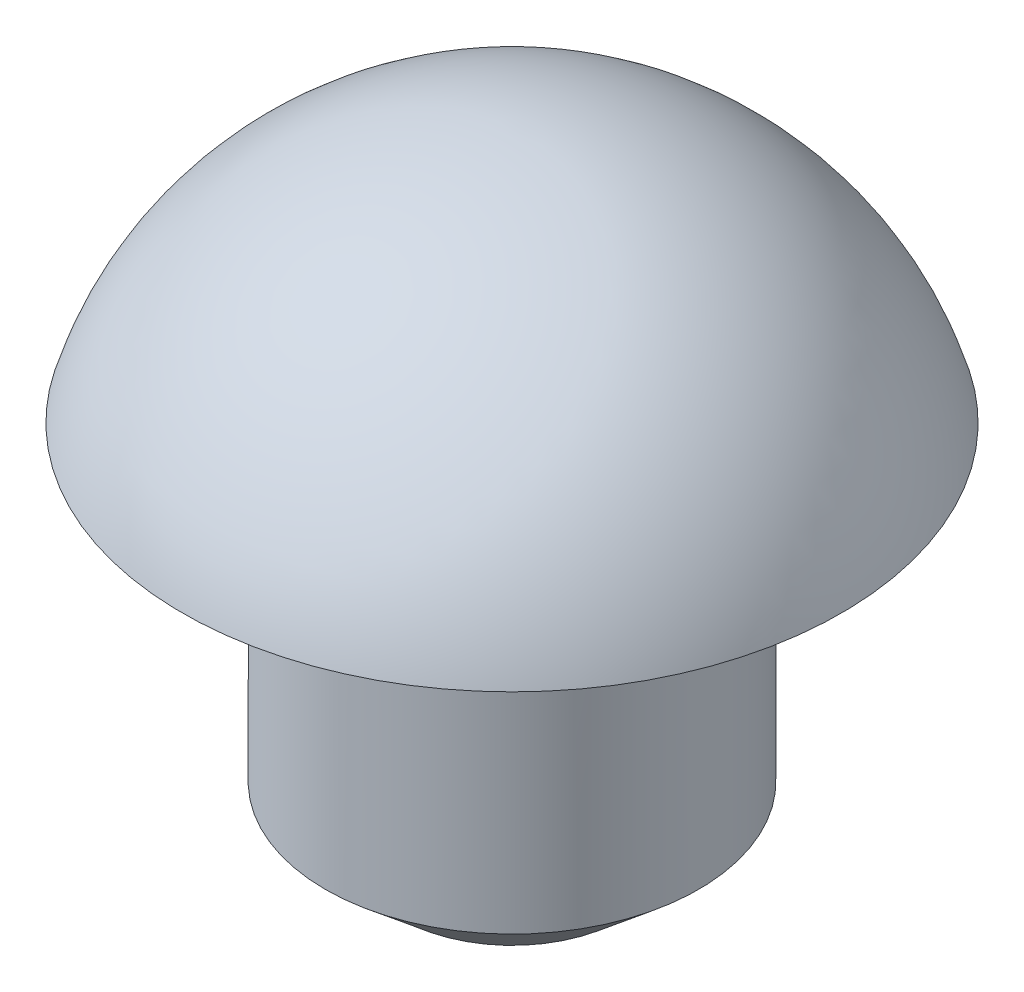
ISO-10303-21;
HEADER;
FILE_DESCRIPTION(('STEP AP214'),'2;1');
FILE_NAME('part.step','',(''),(''),'','','');
FILE_SCHEMA(('AUTOMOTIVE_DESIGN { 1 0 10303 214 1 1 1 1 }'));
ENDSEC;
DATA;
#1=APPLICATION_CONTEXT('core data for automotive mechanical design processes');
#2=APPLICATION_PROTOCOL_DEFINITION('international standard','automotive_design',2000,#1);
#3=PRODUCT_CONTEXT('',#1,'mechanical');
#4=PRODUCT('Part','Part','',(#3));
#5=PRODUCT_RELATED_PRODUCT_CATEGORY('part','',(#4));
#6=PRODUCT_DEFINITION_FORMATION('','',#4);
#7=PRODUCT_DEFINITION_CONTEXT('part definition',#1,'design');
#8=PRODUCT_DEFINITION('design','',#6,#7);
#9=PRODUCT_DEFINITION_SHAPE('','',#8);
#10=(LENGTH_UNIT() NAMED_UNIT(*) SI_UNIT(.MILLI.,.METRE.));
#11=(NAMED_UNIT(*) PLANE_ANGLE_UNIT() SI_UNIT($,.RADIAN.));
#12=(NAMED_UNIT(*) SI_UNIT($,.STERADIAN.) SOLID_ANGLE_UNIT());
#13=UNCERTAINTY_MEASURE_WITH_UNIT(LENGTH_MEASURE(1.E-05),#10,'distance_accuracy_value','');
#14=(GEOMETRIC_REPRESENTATION_CONTEXT(3) GLOBAL_UNCERTAINTY_ASSIGNED_CONTEXT((#13)) GLOBAL_UNIT_ASSIGNED_CONTEXT((#10,
#11,#12)) REPRESENTATION_CONTEXT('',''));
#15=CARTESIAN_POINT('',(0.,0.,0.));
#16=DIRECTION('',(0.,0.,1.));
#17=DIRECTION('',(1.,0.,0.));
#18=AXIS2_PLACEMENT_3D('',#15,#16,#17);
#19=CARTESIAN_POINT('',(-2.65,0.500000000000002,0.));
#20=DIRECTION('',(0.,-1.,0.));
#21=DIRECTION('',(0.,0.,-1.));
#22=AXIS2_PLACEMENT_3D('',#19,#20,#21);
#23=PLANE('',#22);
#24=CARTESIAN_POINT('',(0.,0.5,0.));
#25=DIRECTION('',(0.,-1.,0.));
#26=DIRECTION('',(0.,0.,-1.));
#27=AXIS2_PLACEMENT_3D('',#24,#25,#26);
#28=CIRCLE('',#27,2.65);
#29=CARTESIAN_POINT('',(0.,0.5,-2.65));
#30=VERTEX_POINT('',#29);
#31=EDGE_CURVE('E47',#30,#30,#28,.T.);
#32=ORIENTED_EDGE('',*,*,#31,.T.);
#33=EDGE_LOOP('',(#32));
#34=FACE_BOUND('',#33,.T.);
#35=CARTESIAN_POINT('',(0.,0.500000000000002,0.));
#36=DIRECTION('',(0.,-1.,0.));
#37=DIRECTION('',(0.,0.,-1.));
#38=AXIS2_PLACEMENT_3D('',#35,#36,#37);
#39=CIRCLE('',#38,1.5);
#40=CARTESIAN_POINT('',(0.,0.500000000000002,-1.5));
#41=VERTEX_POINT('',#40);
#42=EDGE_CURVE('E49',#41,#41,#39,.T.);
#43=ORIENTED_EDGE('',*,*,#42,.F.);
#44=EDGE_LOOP('',(#43));
#45=FACE_BOUND('',#44,.T.);
#46=ADVANCED_FACE('F30',(#34,#45),#23,.T.);
#47=CARTESIAN_POINT('',(0.,-7.45771041021499,0.));
#48=DIRECTION('',(0.,-1.,0.));
#49=DIRECTION('',(0.,0.,-1.));
#50=AXIS2_PLACEMENT_3D('',#47,#48,#49);
#51=CYLINDRICAL_SURFACE('',#50,1.5);
#52=CARTESIAN_POINT('',(0.,-1.99999999999999,0.));
#53=DIRECTION('',(0.,1.,0.));
#54=DIRECTION('',(0.,0.,1.));
#55=AXIS2_PLACEMENT_3D('',#52,#53,#54);
#56=CIRCLE('',#55,1.5);
#57=CARTESIAN_POINT('',(0.,-1.99999999999999,1.5));
#58=VERTEX_POINT('',#57);
#59=EDGE_CURVE('E11',#58,#58,#56,.T.);
#60=ORIENTED_EDGE('',*,*,#59,.T.);
#61=EDGE_LOOP('',(#60));
#62=FACE_BOUND('',#61,.T.);
#63=ORIENTED_EDGE('',*,*,#42,.T.);
#64=EDGE_LOOP('',(#63));
#65=FACE_BOUND('',#64,.T.);
#66=ADVANCED_FACE('F63',(#62,#65),#51,.T.);
#67=CARTESIAN_POINT('',(-2.65,-2.5,0.));
#68=DIRECTION('',(0.,1.,0.));
#69=DIRECTION('',(0.,0.,1.));
#70=AXIS2_PLACEMENT_3D('',#67,#68,#69);
#71=PLANE('',#70);
#72=CARTESIAN_POINT('',(0.,-2.5,0.));
#73=DIRECTION('',(0.,1.,0.));
#74=DIRECTION('',(0.,0.,1.));
#75=AXIS2_PLACEMENT_3D('',#72,#73,#74);
#76=CIRCLE('',#75,0.904123203702891);
#77=CARTESIAN_POINT('',(0.,-2.5,0.904123203702891));
#78=VERTEX_POINT('',#77);
#79=EDGE_CURVE('E37',#78,#78,#76,.F.);
#80=ORIENTED_EDGE('',*,*,#79,.T.);
#81=EDGE_LOOP('',(#80));
#82=FACE_BOUND('',#81,.T.);
#83=ADVANCED_FACE('F43',(#82),#71,.F.);
#84=CARTESIAN_POINT('',(0.,-0.255624999999997,0.));
#85=DIRECTION('',(0.,-1.,0.));
#86=DIRECTION('',(-1.,0.,0.));
#87=AXIS2_PLACEMENT_3D('',#84,#85,#86);
#88=SPHERICAL_SURFACE('',#87,2.755625);
#89=CARTESIAN_POINT('',(0.,2.5,0.));
#90=VERTEX_POINT('',#89);
#91=VERTEX_LOOP('',#90);
#92=FACE_BOUND('',#91,.T.);
#93=ORIENTED_EDGE('',*,*,#31,.F.);
#94=EDGE_LOOP('',(#93));
#95=FACE_BOUND('',#94,.T.);
#96=ADVANCED_FACE('F40',(#92,#95),#88,.T.);
#97=CARTESIAN_POINT('',(0.,-2.5,0.));
#98=DIRECTION('',(0.,1.,0.));
#99=DIRECTION('',(0.,0.,1.));
#100=AXIS2_PLACEMENT_3D('',#97,#98,#99);
#101=CONICAL_SURFACE('',#100,0.904123203702892,0.872664625997163);
#102=ORIENTED_EDGE('',*,*,#59,.F.);
#103=EDGE_LOOP('',(#102));
#104=FACE_BOUND('',#103,.T.);
#105=ORIENTED_EDGE('',*,*,#79,.F.);
#106=EDGE_LOOP('',(#105));
#107=FACE_BOUND('',#106,.T.);
#108=ADVANCED_FACE('F32',(#104,#107),#101,.T.);
#109=CLOSED_SHELL('',(#46,#66,#83,#96,#108));
#110=MANIFOLD_SOLID_BREP('B2',#109);
#111=ADVANCED_BREP_SHAPE_REPRESENTATION('',(#18,#110),#14);
#112=SHAPE_DEFINITION_REPRESENTATION(#9,#111);
ENDSEC;
END-ISO-10303-21;
